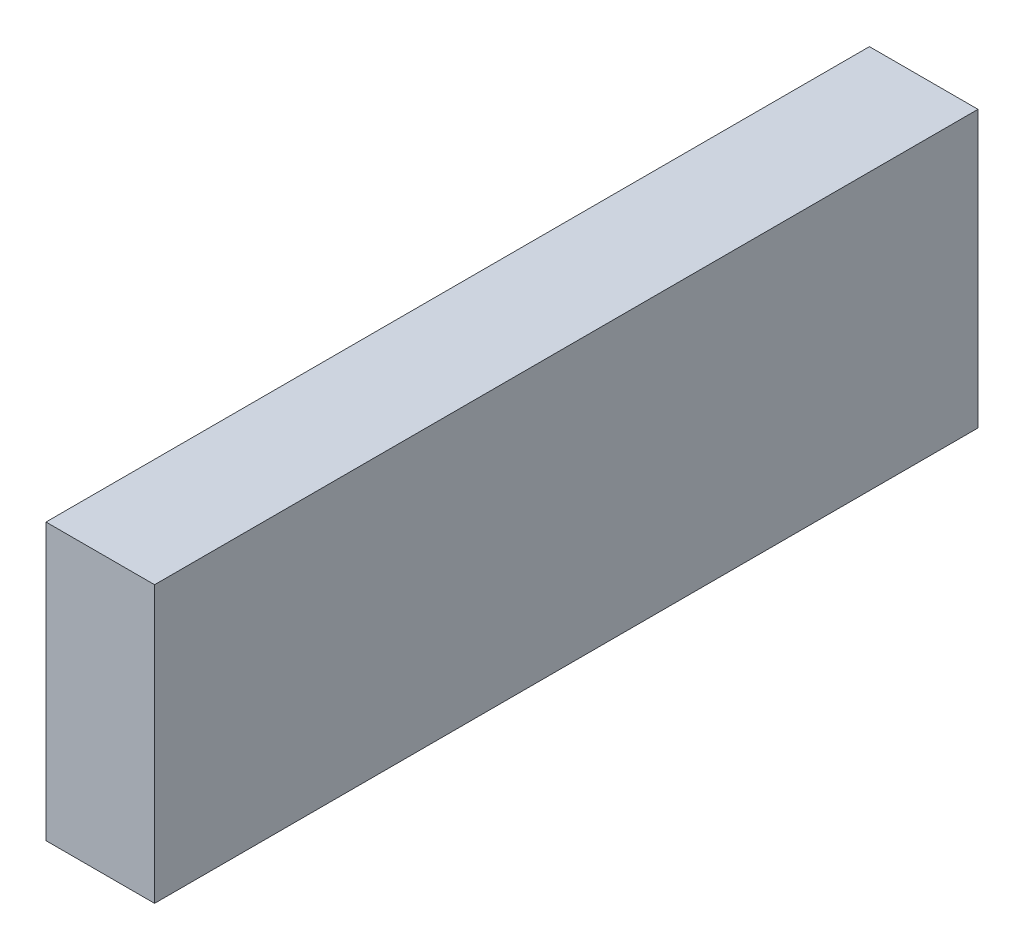
ISO-10303-21;
HEADER;
FILE_DESCRIPTION(('STEP AP214'),'2;1');
FILE_NAME('part.step','',(''),(''),'','','');
FILE_SCHEMA(('AUTOMOTIVE_DESIGN { 1 0 10303 214 1 1 1 1 }'));
ENDSEC;
DATA;
#1=APPLICATION_CONTEXT('core data for automotive mechanical design processes');
#2=APPLICATION_PROTOCOL_DEFINITION('international standard','automotive_design',2000,#1);
#3=PRODUCT_CONTEXT('',#1,'mechanical');
#4=PRODUCT('Part','Part','',(#3));
#5=PRODUCT_RELATED_PRODUCT_CATEGORY('part','',(#4));
#6=PRODUCT_DEFINITION_FORMATION('','',#4);
#7=PRODUCT_DEFINITION_CONTEXT('part definition',#1,'design');
#8=PRODUCT_DEFINITION('design','',#6,#7);
#9=PRODUCT_DEFINITION_SHAPE('','',#8);
#10=(LENGTH_UNIT() NAMED_UNIT(*) SI_UNIT(.MILLI.,.METRE.));
#11=(NAMED_UNIT(*) PLANE_ANGLE_UNIT() SI_UNIT($,.RADIAN.));
#12=(NAMED_UNIT(*) SI_UNIT($,.STERADIAN.) SOLID_ANGLE_UNIT());
#13=UNCERTAINTY_MEASURE_WITH_UNIT(LENGTH_MEASURE(1.E-05),#10,'distance_accuracy_value','');
#14=(GEOMETRIC_REPRESENTATION_CONTEXT(3) GLOBAL_UNCERTAINTY_ASSIGNED_CONTEXT((#13)) GLOBAL_UNIT_ASSIGNED_CONTEXT((#10,
#11,#12)) REPRESENTATION_CONTEXT('',''));
#15=CARTESIAN_POINT('',(0.,0.,0.));
#16=DIRECTION('',(0.,0.,1.));
#17=DIRECTION('',(1.,0.,0.));
#18=AXIS2_PLACEMENT_3D('',#15,#16,#17);
#19=CARTESIAN_POINT('',(-12.,61.,91.));
#20=DIRECTION('',(1.,0.,0.));
#21=DIRECTION('',(0.,0.,-1.));
#22=AXIS2_PLACEMENT_3D('',#19,#20,#21);
#23=PLANE('',#22);
#24=DIRECTION('',(0.,0.,1.));
#25=VECTOR('',#24,1.);
#26=CARTESIAN_POINT('',(-12.,0.,91.));
#27=LINE('',#26,#25);
#28=CARTESIAN_POINT('',(-12.,0.,-91.));
#29=VERTEX_POINT('',#28);
#30=CARTESIAN_POINT('',(-12.,0.,91.));
#31=VERTEX_POINT('',#30);
#32=EDGE_CURVE('E96',#29,#31,#27,.T.);
#33=ORIENTED_EDGE('',*,*,#32,.T.);
#34=DIRECTION('',(0.,-1.,0.));
#35=VECTOR('',#34,1.);
#36=CARTESIAN_POINT('',(-12.,61.,91.));
#37=LINE('',#36,#35);
#38=CARTESIAN_POINT('',(-12.,61.,91.));
#39=VERTEX_POINT('',#38);
#40=EDGE_CURVE('E11',#39,#31,#37,.T.);
#41=ORIENTED_EDGE('',*,*,#40,.F.);
#42=DIRECTION('',(0.,0.,1.));
#43=VECTOR('',#42,1.);
#44=CARTESIAN_POINT('',(-12.,61.,91.));
#45=LINE('',#44,#43);
#46=CARTESIAN_POINT('',(-12.,61.,-91.));
#47=VERTEX_POINT('',#46);
#48=EDGE_CURVE('E84',#47,#39,#45,.T.);
#49=ORIENTED_EDGE('',*,*,#48,.F.);
#50=DIRECTION('',(0.,-1.,0.));
#51=VECTOR('',#50,1.);
#52=CARTESIAN_POINT('',(-12.,61.,-91.));
#53=LINE('',#52,#51);
#54=EDGE_CURVE('E92',#47,#29,#53,.T.);
#55=ORIENTED_EDGE('',*,*,#54,.T.);
#56=EDGE_LOOP('',(#33,#41,#49,#55));
#57=FACE_BOUND('',#56,.T.);
#58=ADVANCED_FACE('F33',(#57),#23,.F.);
#59=CARTESIAN_POINT('',(12.,61.,91.));
#60=DIRECTION('',(0.,0.,-1.));
#61=DIRECTION('',(-1.,0.,0.));
#62=AXIS2_PLACEMENT_3D('',#59,#60,#61);
#63=PLANE('',#62);
#64=DIRECTION('',(1.,0.,0.));
#65=VECTOR('',#64,1.);
#66=CARTESIAN_POINT('',(12.,0.,91.));
#67=LINE('',#66,#65);
#68=CARTESIAN_POINT('',(12.,0.,91.));
#69=VERTEX_POINT('',#68);
#70=EDGE_CURVE('E88',#31,#69,#67,.T.);
#71=ORIENTED_EDGE('',*,*,#70,.T.);
#72=DIRECTION('',(0.,-1.,0.));
#73=VECTOR('',#72,1.);
#74=CARTESIAN_POINT('',(12.,61.,91.));
#75=LINE('',#74,#73);
#76=CARTESIAN_POINT('',(12.,61.,91.));
#77=VERTEX_POINT('',#76);
#78=EDGE_CURVE('E41',#77,#69,#75,.T.);
#79=ORIENTED_EDGE('',*,*,#78,.F.);
#80=DIRECTION('',(1.,0.,0.));
#81=VECTOR('',#80,1.);
#82=CARTESIAN_POINT('',(12.,61.,91.));
#83=LINE('',#82,#81);
#84=EDGE_CURVE('E79',#39,#77,#83,.T.);
#85=ORIENTED_EDGE('',*,*,#84,.F.);
#86=ORIENTED_EDGE('',*,*,#40,.T.);
#87=EDGE_LOOP('',(#71,#79,#85,#86));
#88=FACE_BOUND('',#87,.T.);
#89=ADVANCED_FACE('F87',(#88),#63,.F.);
#90=CARTESIAN_POINT('',(12.,61.,91.));
#91=DIRECTION('',(-1.,0.,0.));
#92=DIRECTION('',(0.,0.,1.));
#93=AXIS2_PLACEMENT_3D('',#90,#91,#92);
#94=PLANE('',#93);
#95=DIRECTION('',(0.,0.,-1.));
#96=VECTOR('',#95,1.);
#97=CARTESIAN_POINT('',(12.,0.,91.));
#98=LINE('',#97,#96);
#99=CARTESIAN_POINT('',(12.,0.,-91.));
#100=VERTEX_POINT('',#99);
#101=EDGE_CURVE('E66',#69,#100,#98,.T.);
#102=ORIENTED_EDGE('',*,*,#101,.T.);
#103=DIRECTION('',(0.,-1.,0.));
#104=VECTOR('',#103,1.);
#105=CARTESIAN_POINT('',(12.,61.,-91.));
#106=LINE('',#105,#104);
#107=CARTESIAN_POINT('',(12.,61.,-91.));
#108=VERTEX_POINT('',#107);
#109=EDGE_CURVE('E89',#108,#100,#106,.T.);
#110=ORIENTED_EDGE('',*,*,#109,.F.);
#111=DIRECTION('',(0.,0.,-1.));
#112=VECTOR('',#111,1.);
#113=CARTESIAN_POINT('',(12.,61.,91.));
#114=LINE('',#113,#112);
#115=EDGE_CURVE('E82',#77,#108,#114,.T.);
#116=ORIENTED_EDGE('',*,*,#115,.F.);
#117=ORIENTED_EDGE('',*,*,#78,.T.);
#118=EDGE_LOOP('',(#102,#110,#116,#117));
#119=FACE_BOUND('',#118,.T.);
#120=ADVANCED_FACE('F90',(#119),#94,.F.);
#121=CARTESIAN_POINT('',(12.,61.,-91.));
#122=DIRECTION('',(0.,0.,1.));
#123=DIRECTION('',(1.,0.,0.));
#124=AXIS2_PLACEMENT_3D('',#121,#122,#123);
#125=PLANE('',#124);
#126=DIRECTION('',(-1.,0.,0.));
#127=VECTOR('',#126,1.);
#128=CARTESIAN_POINT('',(12.,0.,-91.));
#129=LINE('',#128,#127);
#130=EDGE_CURVE('E72',#100,#29,#129,.T.);
#131=ORIENTED_EDGE('',*,*,#130,.T.);
#132=ORIENTED_EDGE('',*,*,#54,.F.);
#133=DIRECTION('',(-1.,0.,0.));
#134=VECTOR('',#133,1.);
#135=CARTESIAN_POINT('',(12.,61.,-91.));
#136=LINE('',#135,#134);
#137=EDGE_CURVE('E49',#108,#47,#136,.T.);
#138=ORIENTED_EDGE('',*,*,#137,.F.);
#139=ORIENTED_EDGE('',*,*,#109,.T.);
#140=EDGE_LOOP('',(#131,#132,#138,#139));
#141=FACE_BOUND('',#140,.T.);
#142=ADVANCED_FACE('F103',(#141),#125,.F.);
#143=CARTESIAN_POINT('',(0.,61.,0.));
#144=DIRECTION('',(0.,1.,0.));
#145=DIRECTION('',(0.,0.,1.));
#146=AXIS2_PLACEMENT_3D('',#143,#144,#145);
#147=PLANE('',#146);
#148=ORIENTED_EDGE('',*,*,#48,.T.);
#149=ORIENTED_EDGE('',*,*,#84,.T.);
#150=ORIENTED_EDGE('',*,*,#115,.T.);
#151=ORIENTED_EDGE('',*,*,#137,.T.);
#152=EDGE_LOOP('',(#148,#149,#150,#151));
#153=FACE_BOUND('',#152,.T.);
#154=ADVANCED_FACE('F80',(#153),#147,.T.);
#155=CARTESIAN_POINT('',(0.,0.,0.));
#156=DIRECTION('',(0.,1.,0.));
#157=DIRECTION('',(0.,0.,1.));
#158=AXIS2_PLACEMENT_3D('',#155,#156,#157);
#159=PLANE('',#158);
#160=ORIENTED_EDGE('',*,*,#32,.F.);
#161=ORIENTED_EDGE('',*,*,#130,.F.);
#162=ORIENTED_EDGE('',*,*,#101,.F.);
#163=ORIENTED_EDGE('',*,*,#70,.F.);
#164=EDGE_LOOP('',(#160,#161,#162,#163));
#165=FACE_BOUND('',#164,.T.);
#166=ADVANCED_FACE('F106',(#165),#159,.F.);
#167=CLOSED_SHELL('',(#58,#89,#120,#142,#154,#166));
#168=MANIFOLD_SOLID_BREP('B2',#167);
#169=ADVANCED_BREP_SHAPE_REPRESENTATION('',(#18,#168),#14);
#170=SHAPE_DEFINITION_REPRESENTATION(#9,#169);
ENDSEC;
END-ISO-10303-21;
